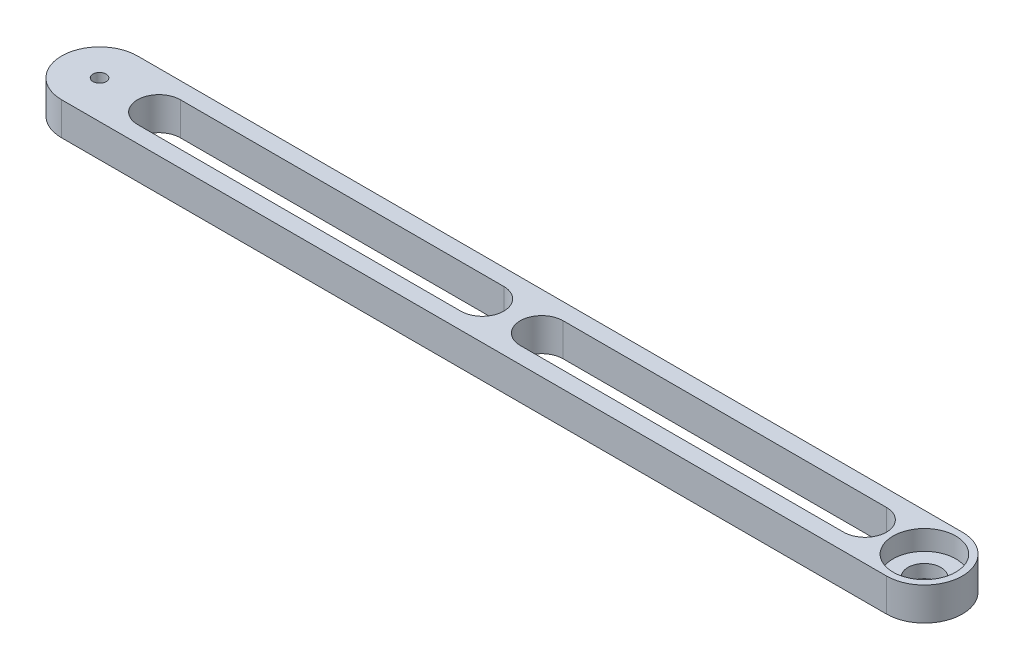
ISO-10303-21;
HEADER;
FILE_DESCRIPTION(('STEP AP214'),'2;1');
FILE_NAME('part.step','',(''),(''),'','','');
FILE_SCHEMA(('AUTOMOTIVE_DESIGN { 1 0 10303 214 1 1 1 1 }'));
ENDSEC;
DATA;
#1=APPLICATION_CONTEXT('core data for automotive mechanical design processes');
#2=APPLICATION_PROTOCOL_DEFINITION('international standard','automotive_design',2000,#1);
#3=PRODUCT_CONTEXT('',#1,'mechanical');
#4=PRODUCT('Part','Part','',(#3));
#5=PRODUCT_RELATED_PRODUCT_CATEGORY('part','',(#4));
#6=PRODUCT_DEFINITION_FORMATION('','',#4);
#7=PRODUCT_DEFINITION_CONTEXT('part definition',#1,'design');
#8=PRODUCT_DEFINITION('design','',#6,#7);
#9=PRODUCT_DEFINITION_SHAPE('','',#8);
#10=(LENGTH_UNIT() NAMED_UNIT(*) SI_UNIT(.MILLI.,.METRE.));
#11=(NAMED_UNIT(*) PLANE_ANGLE_UNIT() SI_UNIT($,.RADIAN.));
#12=(NAMED_UNIT(*) SI_UNIT($,.STERADIAN.) SOLID_ANGLE_UNIT());
#13=UNCERTAINTY_MEASURE_WITH_UNIT(LENGTH_MEASURE(1.E-05),#10,'distance_accuracy_value','');
#14=(GEOMETRIC_REPRESENTATION_CONTEXT(3) GLOBAL_UNCERTAINTY_ASSIGNED_CONTEXT((#13)) GLOBAL_UNIT_ASSIGNED_CONTEXT((#10,
#11,#12)) REPRESENTATION_CONTEXT('',''));
#15=CARTESIAN_POINT('',(0.,0.,0.));
#16=DIRECTION('',(0.,0.,1.));
#17=DIRECTION('',(1.,0.,0.));
#18=AXIS2_PLACEMENT_3D('',#15,#16,#17);
#19=CARTESIAN_POINT('',(0.,10.,0.));
#20=DIRECTION('',(0.,1.,0.));
#21=DIRECTION('',(0.,0.,1.));
#22=AXIS2_PLACEMENT_3D('',#19,#20,#21);
#23=PLANE('',#22);
#24=CARTESIAN_POINT('',(18.,10.,0.));
#25=DIRECTION('',(0.,1.,0.));
#26=DIRECTION('',(0.,0.,1.));
#27=AXIS2_PLACEMENT_3D('',#24,#25,#26);
#28=CIRCLE('',#27,6.5);
#29=CARTESIAN_POINT('',(18.,10.,-6.5));
#30=VERTEX_POINT('',#29);
#31=CARTESIAN_POINT('',(18.,10.,6.5));
#32=VERTEX_POINT('',#31);
#33=EDGE_CURVE('E50',#30,#32,#28,.T.);
#34=ORIENTED_EDGE('',*,*,#33,.F.);
#35=DIRECTION('',(-1.,0.,0.));
#36=VECTOR('',#35,1.);
#37=CARTESIAN_POINT('',(18.,10.,-6.5));
#38=LINE('',#37,#36);
#39=CARTESIAN_POINT('',(116.,10.,-6.5));
#40=VERTEX_POINT('',#39);
#41=EDGE_CURVE('E145',#40,#30,#38,.T.);
#42=ORIENTED_EDGE('',*,*,#41,.F.);
#43=CARTESIAN_POINT('',(116.,10.,0.));
#44=DIRECTION('',(0.,1.,0.));
#45=DIRECTION('',(0.,0.,1.));
#46=AXIS2_PLACEMENT_3D('',#43,#44,#45);
#47=CIRCLE('',#46,6.5);
#48=CARTESIAN_POINT('',(116.,10.,6.5));
#49=VERTEX_POINT('',#48);
#50=EDGE_CURVE('E148',#49,#40,#47,.T.);
#51=ORIENTED_EDGE('',*,*,#50,.F.);
#52=DIRECTION('',(1.,0.,0.));
#53=VECTOR('',#52,1.);
#54=CARTESIAN_POINT('',(18.,10.,6.5));
#55=LINE('',#54,#53);
#56=EDGE_CURVE('E154',#32,#49,#55,.T.);
#57=ORIENTED_EDGE('',*,*,#56,.F.);
#58=EDGE_LOOP('',(#34,#42,#51,#57));
#59=FACE_BOUND('',#58,.T.);
#60=CARTESIAN_POINT('',(134.,10.,0.));
#61=DIRECTION('',(0.,1.,0.));
#62=DIRECTION('',(0.,0.,1.));
#63=AXIS2_PLACEMENT_3D('',#60,#61,#62);
#64=CIRCLE('',#63,6.5);
#65=CARTESIAN_POINT('',(134.,10.,-6.5));
#66=VERTEX_POINT('',#65);
#67=CARTESIAN_POINT('',(134.,10.,6.5));
#68=VERTEX_POINT('',#67);
#69=EDGE_CURVE('E58',#66,#68,#64,.T.);
#70=ORIENTED_EDGE('',*,*,#69,.F.);
#71=DIRECTION('',(-1.,0.,0.));
#72=VECTOR('',#71,1.);
#73=CARTESIAN_POINT('',(134.,10.,-6.5));
#74=LINE('',#73,#72);
#75=CARTESIAN_POINT('',(232.,10.,-6.5));
#76=VERTEX_POINT('',#75);
#77=EDGE_CURVE('E169',#76,#66,#74,.T.);
#78=ORIENTED_EDGE('',*,*,#77,.F.);
#79=CARTESIAN_POINT('',(232.,10.,0.));
#80=DIRECTION('',(0.,1.,0.));
#81=DIRECTION('',(0.,0.,1.));
#82=AXIS2_PLACEMENT_3D('',#79,#80,#81);
#83=CIRCLE('',#82,6.5);
#84=CARTESIAN_POINT('',(232.,10.,6.5));
#85=VERTEX_POINT('',#84);
#86=EDGE_CURVE('E183',#85,#76,#83,.T.);
#87=ORIENTED_EDGE('',*,*,#86,.F.);
#88=DIRECTION('',(1.,0.,0.));
#89=VECTOR('',#88,1.);
#90=CARTESIAN_POINT('',(134.,10.,6.5));
#91=LINE('',#90,#89);
#92=EDGE_CURVE('E180',#68,#85,#91,.T.);
#93=ORIENTED_EDGE('',*,*,#92,.F.);
#94=EDGE_LOOP('',(#70,#78,#87,#93));
#95=FACE_BOUND('',#94,.T.);
#96=CARTESIAN_POINT('',(250.,10.,0.));
#97=DIRECTION('',(0.,1.,0.));
#98=DIRECTION('',(0.,0.,1.));
#99=AXIS2_PLACEMENT_3D('',#96,#97,#98);
#100=CIRCLE('',#99,9.50000000000001);
#101=CARTESIAN_POINT('',(250.,10.,9.50000000000001));
#102=VERTEX_POINT('',#101);
#103=EDGE_CURVE('E200',#102,#102,#100,.T.);
#104=ORIENTED_EDGE('',*,*,#103,.F.);
#105=EDGE_LOOP('',(#104));
#106=FACE_BOUND('',#105,.T.);
#107=CARTESIAN_POINT('',(0.,10.,0.));
#108=DIRECTION('',(0.,1.,0.));
#109=DIRECTION('',(0.,0.,1.));
#110=AXIS2_PLACEMENT_3D('',#107,#108,#109);
#111=CIRCLE('',#110,11.5);
#112=CARTESIAN_POINT('',(0.,10.,-11.5));
#113=VERTEX_POINT('',#112);
#114=CARTESIAN_POINT('',(0.,10.,11.5));
#115=VERTEX_POINT('',#114);
#116=EDGE_CURVE('E209',#113,#115,#111,.T.);
#117=ORIENTED_EDGE('',*,*,#116,.T.);
#118=DIRECTION('',(1.,0.,0.));
#119=VECTOR('',#118,1.);
#120=CARTESIAN_POINT('',(0.,10.,11.5));
#121=LINE('',#120,#119);
#122=CARTESIAN_POINT('',(250.,10.,11.5));
#123=VERTEX_POINT('',#122);
#124=EDGE_CURVE('E212',#115,#123,#121,.T.);
#125=ORIENTED_EDGE('',*,*,#124,.T.);
#126=CARTESIAN_POINT('',(250.,10.,0.));
#127=DIRECTION('',(0.,1.,0.));
#128=DIRECTION('',(0.,0.,1.));
#129=AXIS2_PLACEMENT_3D('',#126,#127,#128);
#130=CIRCLE('',#129,11.5);
#131=CARTESIAN_POINT('',(250.,10.,-11.5));
#132=VERTEX_POINT('',#131);
#133=EDGE_CURVE('E215',#123,#132,#130,.T.);
#134=ORIENTED_EDGE('',*,*,#133,.T.);
#135=DIRECTION('',(-1.,0.,0.));
#136=VECTOR('',#135,1.);
#137=CARTESIAN_POINT('',(0.,10.,-11.5));
#138=LINE('',#137,#136);
#139=EDGE_CURVE('E217',#132,#113,#138,.T.);
#140=ORIENTED_EDGE('',*,*,#139,.T.);
#141=EDGE_LOOP('',(#117,#125,#134,#140));
#142=FACE_BOUND('',#141,.T.);
#143=CARTESIAN_POINT('',(0.,10.,0.));
#144=DIRECTION('',(0.,1.,0.));
#145=DIRECTION('',(0.,0.,1.));
#146=AXIS2_PLACEMENT_3D('',#143,#144,#145);
#147=CIRCLE('',#146,2.);
#148=CARTESIAN_POINT('',(0.,10.,2.));
#149=VERTEX_POINT('',#148);
#150=EDGE_CURVE('E203',#149,#149,#147,.T.);
#151=ORIENTED_EDGE('',*,*,#150,.F.);
#152=EDGE_LOOP('',(#151));
#153=FACE_BOUND('',#152,.T.);
#154=ADVANCED_FACE('F34',(#59,#95,#106,#142,#153),#23,.T.);
#155=CARTESIAN_POINT('',(0.,0.,0.));
#156=DIRECTION('',(0.,1.,0.));
#157=DIRECTION('',(0.,0.,1.));
#158=AXIS2_PLACEMENT_3D('',#155,#156,#157);
#159=PLANE('',#158);
#160=DIRECTION('',(-1.,0.,0.));
#161=VECTOR('',#160,1.);
#162=CARTESIAN_POINT('',(18.,0.,-6.5));
#163=LINE('',#162,#161);
#164=CARTESIAN_POINT('',(116.,0.,-6.5));
#165=VERTEX_POINT('',#164);
#166=CARTESIAN_POINT('',(18.,0.,-6.5));
#167=VERTEX_POINT('',#166);
#168=EDGE_CURVE('E132',#165,#167,#163,.T.);
#169=ORIENTED_EDGE('',*,*,#168,.T.);
#170=CARTESIAN_POINT('',(18.,0.,0.));
#171=DIRECTION('',(0.,1.,0.));
#172=DIRECTION('',(0.,0.,1.));
#173=AXIS2_PLACEMENT_3D('',#170,#171,#172);
#174=CIRCLE('',#173,6.5);
#175=CARTESIAN_POINT('',(18.,0.,6.5));
#176=VERTEX_POINT('',#175);
#177=EDGE_CURVE('E126',#167,#176,#174,.T.);
#178=ORIENTED_EDGE('',*,*,#177,.T.);
#179=DIRECTION('',(1.,0.,0.));
#180=VECTOR('',#179,1.);
#181=CARTESIAN_POINT('',(18.,0.,6.5));
#182=LINE('',#181,#180);
#183=CARTESIAN_POINT('',(116.,0.,6.5));
#184=VERTEX_POINT('',#183);
#185=EDGE_CURVE('E136',#176,#184,#182,.T.);
#186=ORIENTED_EDGE('',*,*,#185,.T.);
#187=CARTESIAN_POINT('',(116.,0.,0.));
#188=DIRECTION('',(0.,1.,0.));
#189=DIRECTION('',(0.,0.,1.));
#190=AXIS2_PLACEMENT_3D('',#187,#188,#189);
#191=CIRCLE('',#190,6.5);
#192=EDGE_CURVE('E140',#184,#165,#191,.T.);
#193=ORIENTED_EDGE('',*,*,#192,.T.);
#194=EDGE_LOOP('',(#169,#178,#186,#193));
#195=FACE_BOUND('',#194,.T.);
#196=DIRECTION('',(-1.,0.,0.));
#197=VECTOR('',#196,1.);
#198=CARTESIAN_POINT('',(134.,0.,-6.5));
#199=LINE('',#198,#197);
#200=CARTESIAN_POINT('',(232.,0.,-6.5));
#201=VERTEX_POINT('',#200);
#202=CARTESIAN_POINT('',(134.,0.,-6.5));
#203=VERTEX_POINT('',#202);
#204=EDGE_CURVE('E175',#201,#203,#199,.T.);
#205=ORIENTED_EDGE('',*,*,#204,.T.);
#206=CARTESIAN_POINT('',(134.,0.,0.));
#207=DIRECTION('',(0.,1.,0.));
#208=DIRECTION('',(0.,0.,1.));
#209=AXIS2_PLACEMENT_3D('',#206,#207,#208);
#210=CIRCLE('',#209,6.5);
#211=CARTESIAN_POINT('',(134.,0.,6.5));
#212=VERTEX_POINT('',#211);
#213=EDGE_CURVE('E165',#203,#212,#210,.T.);
#214=ORIENTED_EDGE('',*,*,#213,.T.);
#215=DIRECTION('',(1.,0.,0.));
#216=VECTOR('',#215,1.);
#217=CARTESIAN_POINT('',(134.,0.,6.5));
#218=LINE('',#217,#216);
#219=CARTESIAN_POINT('',(232.,0.,6.5));
#220=VERTEX_POINT('',#219);
#221=EDGE_CURVE('E168',#212,#220,#218,.T.);
#222=ORIENTED_EDGE('',*,*,#221,.T.);
#223=CARTESIAN_POINT('',(232.,0.,0.));
#224=DIRECTION('',(0.,1.,0.));
#225=DIRECTION('',(0.,0.,1.));
#226=AXIS2_PLACEMENT_3D('',#223,#224,#225);
#227=CIRCLE('',#226,6.5);
#228=EDGE_CURVE('E172',#220,#201,#227,.T.);
#229=ORIENTED_EDGE('',*,*,#228,.T.);
#230=EDGE_LOOP('',(#205,#214,#222,#229));
#231=FACE_BOUND('',#230,.T.);
#232=CARTESIAN_POINT('',(250.,0.,0.));
#233=DIRECTION('',(0.,-1.,0.));
#234=DIRECTION('',(0.,0.,-1.));
#235=AXIS2_PLACEMENT_3D('',#232,#233,#234);
#236=CIRCLE('',#235,4.99999999999999);
#237=CARTESIAN_POINT('',(250.,0.,-4.99999999999999));
#238=VERTEX_POINT('',#237);
#239=EDGE_CURVE('E161',#238,#238,#236,.T.);
#240=ORIENTED_EDGE('',*,*,#239,.F.);
#241=EDGE_LOOP('',(#240));
#242=FACE_BOUND('',#241,.T.);
#243=CARTESIAN_POINT('',(0.,0.,0.));
#244=DIRECTION('',(0.,1.,0.));
#245=DIRECTION('',(0.,0.,1.));
#246=AXIS2_PLACEMENT_3D('',#243,#244,#245);
#247=CIRCLE('',#246,11.5);
#248=CARTESIAN_POINT('',(0.,0.,-11.5));
#249=VERTEX_POINT('',#248);
#250=CARTESIAN_POINT('',(0.,0.,11.5));
#251=VERTEX_POINT('',#250);
#252=EDGE_CURVE('E206',#249,#251,#247,.T.);
#253=ORIENTED_EDGE('',*,*,#252,.F.);
#254=DIRECTION('',(-1.,0.,0.));
#255=VECTOR('',#254,1.);
#256=CARTESIAN_POINT('',(0.,0.,-11.5));
#257=LINE('',#256,#255);
#258=CARTESIAN_POINT('',(250.,0.,-11.5));
#259=VERTEX_POINT('',#258);
#260=EDGE_CURVE('E213',#259,#249,#257,.T.);
#261=ORIENTED_EDGE('',*,*,#260,.F.);
#262=CARTESIAN_POINT('',(250.,0.,0.));
#263=DIRECTION('',(0.,1.,0.));
#264=DIRECTION('',(0.,0.,1.));
#265=AXIS2_PLACEMENT_3D('',#262,#263,#264);
#266=CIRCLE('',#265,11.5);
#267=CARTESIAN_POINT('',(250.,0.,11.5));
#268=VERTEX_POINT('',#267);
#269=EDGE_CURVE('E224',#268,#259,#266,.T.);
#270=ORIENTED_EDGE('',*,*,#269,.F.);
#271=DIRECTION('',(1.,0.,0.));
#272=VECTOR('',#271,1.);
#273=CARTESIAN_POINT('',(0.,0.,11.5));
#274=LINE('',#273,#272);
#275=EDGE_CURVE('E222',#251,#268,#274,.T.);
#276=ORIENTED_EDGE('',*,*,#275,.F.);
#277=EDGE_LOOP('',(#253,#261,#270,#276));
#278=FACE_BOUND('',#277,.T.);
#279=CARTESIAN_POINT('',(0.,0.,0.));
#280=DIRECTION('',(0.,1.,0.));
#281=DIRECTION('',(0.,0.,1.));
#282=AXIS2_PLACEMENT_3D('',#279,#280,#281);
#283=CIRCLE('',#282,2.);
#284=CARTESIAN_POINT('',(0.,0.,2.));
#285=VERTEX_POINT('',#284);
#286=EDGE_CURVE('E199',#285,#285,#283,.T.);
#287=ORIENTED_EDGE('',*,*,#286,.T.);
#288=EDGE_LOOP('',(#287));
#289=FACE_BOUND('',#288,.T.);
#290=ADVANCED_FACE('F142',(#195,#231,#242,#278,#289),#159,.F.);
#291=CARTESIAN_POINT('',(0.,10.,0.));
#292=DIRECTION('',(0.,-1.,0.));
#293=DIRECTION('',(0.,0.,-1.));
#294=AXIS2_PLACEMENT_3D('',#291,#292,#293);
#295=CYLINDRICAL_SURFACE('',#294,11.5);
#296=ORIENTED_EDGE('',*,*,#252,.T.);
#297=DIRECTION('',(0.,-1.,0.));
#298=VECTOR('',#297,1.);
#299=CARTESIAN_POINT('',(0.,10.,11.5));
#300=LINE('',#299,#298);
#301=EDGE_CURVE('E11',#115,#251,#300,.T.);
#302=ORIENTED_EDGE('',*,*,#301,.F.);
#303=ORIENTED_EDGE('',*,*,#116,.F.);
#304=DIRECTION('',(0.,-1.,0.));
#305=VECTOR('',#304,1.);
#306=CARTESIAN_POINT('',(0.,10.,-11.5));
#307=LINE('',#306,#305);
#308=EDGE_CURVE('E219',#113,#249,#307,.T.);
#309=ORIENTED_EDGE('',*,*,#308,.T.);
#310=EDGE_LOOP('',(#296,#302,#303,#309));
#311=FACE_BOUND('',#310,.T.);
#312=ADVANCED_FACE('F36',(#311),#295,.T.);
#313=CARTESIAN_POINT('',(0.,10.,11.5));
#314=DIRECTION('',(0.,0.,-1.));
#315=DIRECTION('',(-1.,0.,0.));
#316=AXIS2_PLACEMENT_3D('',#313,#314,#315);
#317=PLANE('',#316);
#318=ORIENTED_EDGE('',*,*,#275,.T.);
#319=DIRECTION('',(0.,-1.,0.));
#320=VECTOR('',#319,1.);
#321=CARTESIAN_POINT('',(250.,10.,11.5));
#322=LINE('',#321,#320);
#323=EDGE_CURVE('E43',#123,#268,#322,.T.);
#324=ORIENTED_EDGE('',*,*,#323,.F.);
#325=ORIENTED_EDGE('',*,*,#124,.F.);
#326=ORIENTED_EDGE('',*,*,#301,.T.);
#327=EDGE_LOOP('',(#318,#324,#325,#326));
#328=FACE_BOUND('',#327,.T.);
#329=ADVANCED_FACE('F253',(#328),#317,.F.);
#330=CARTESIAN_POINT('',(250.,10.,0.));
#331=DIRECTION('',(0.,-1.,0.));
#332=DIRECTION('',(0.,0.,-1.));
#333=AXIS2_PLACEMENT_3D('',#330,#331,#332);
#334=CYLINDRICAL_SURFACE('',#333,11.5);
#335=ORIENTED_EDGE('',*,*,#269,.T.);
#336=DIRECTION('',(0.,-1.,0.));
#337=VECTOR('',#336,1.);
#338=CARTESIAN_POINT('',(250.,10.,-11.5));
#339=LINE('',#338,#337);
#340=EDGE_CURVE('E229',#132,#259,#339,.T.);
#341=ORIENTED_EDGE('',*,*,#340,.F.);
#342=ORIENTED_EDGE('',*,*,#133,.F.);
#343=ORIENTED_EDGE('',*,*,#323,.T.);
#344=EDGE_LOOP('',(#335,#341,#342,#343));
#345=FACE_BOUND('',#344,.T.);
#346=ADVANCED_FACE('F237',(#345),#334,.T.);
#347=CARTESIAN_POINT('',(0.,10.,-11.5));
#348=DIRECTION('',(0.,0.,1.));
#349=DIRECTION('',(1.,0.,0.));
#350=AXIS2_PLACEMENT_3D('',#347,#348,#349);
#351=PLANE('',#350);
#352=ORIENTED_EDGE('',*,*,#260,.T.);
#353=ORIENTED_EDGE('',*,*,#308,.F.);
#354=ORIENTED_EDGE('',*,*,#139,.F.);
#355=ORIENTED_EDGE('',*,*,#340,.T.);
#356=EDGE_LOOP('',(#352,#353,#354,#355));
#357=FACE_BOUND('',#356,.T.);
#358=ADVANCED_FACE('F246',(#357),#351,.F.);
#359=CARTESIAN_POINT('',(0.,10.,0.));
#360=DIRECTION('',(0.,-1.,0.));
#361=DIRECTION('',(0.,0.,-1.));
#362=AXIS2_PLACEMENT_3D('',#359,#360,#361);
#363=CYLINDRICAL_SURFACE('',#362,2.);
#364=ORIENTED_EDGE('',*,*,#150,.T.);
#365=EDGE_LOOP('',(#364));
#366=FACE_BOUND('',#365,.T.);
#367=ORIENTED_EDGE('',*,*,#286,.F.);
#368=EDGE_LOOP('',(#367));
#369=FACE_BOUND('',#368,.T.);
#370=ADVANCED_FACE('F269',(#366,#369),#363,.F.);
#371=CARTESIAN_POINT('',(250.,4.,0.));
#372=DIRECTION('',(0.,1.,0.));
#373=DIRECTION('',(0.,0.,1.));
#374=AXIS2_PLACEMENT_3D('',#371,#372,#373);
#375=CYLINDRICAL_SURFACE('',#374,9.50000000000001);
#376=CARTESIAN_POINT('',(250.,4.,0.));
#377=DIRECTION('',(0.,1.,0.));
#378=DIRECTION('',(0.,0.,1.));
#379=AXIS2_PLACEMENT_3D('',#376,#377,#378);
#380=CIRCLE('',#379,9.50000000000001);
#381=CARTESIAN_POINT('',(250.,4.,9.50000000000001));
#382=VERTEX_POINT('',#381);
#383=EDGE_CURVE('E196',#382,#382,#380,.T.);
#384=ORIENTED_EDGE('',*,*,#383,.F.);
#385=EDGE_LOOP('',(#384));
#386=FACE_BOUND('',#385,.T.);
#387=ORIENTED_EDGE('',*,*,#103,.T.);
#388=EDGE_LOOP('',(#387));
#389=FACE_BOUND('',#388,.T.);
#390=ADVANCED_FACE('F276',(#386,#389),#375,.F.);
#391=CARTESIAN_POINT('',(250.,4.,0.));
#392=DIRECTION('',(0.,1.,0.));
#393=DIRECTION('',(0.,0.,1.));
#394=AXIS2_PLACEMENT_3D('',#391,#392,#393);
#395=PLANE('',#394);
#396=CARTESIAN_POINT('',(250.,4.,0.));
#397=DIRECTION('',(0.,1.,0.));
#398=DIRECTION('',(0.,0.,1.));
#399=AXIS2_PLACEMENT_3D('',#396,#397,#398);
#400=CIRCLE('',#399,4.99999999999999);
#401=CARTESIAN_POINT('',(250.,4.,4.99999999999999));
#402=VERTEX_POINT('',#401);
#403=EDGE_CURVE('E38',#402,#402,#400,.T.);
#404=ORIENTED_EDGE('',*,*,#403,.F.);
#405=EDGE_LOOP('',(#404));
#406=FACE_BOUND('',#405,.T.);
#407=ORIENTED_EDGE('',*,*,#383,.T.);
#408=EDGE_LOOP('',(#407));
#409=FACE_BOUND('',#408,.T.);
#410=ADVANCED_FACE('F281',(#406,#409),#395,.T.);
#411=CARTESIAN_POINT('',(250.,10.,0.));
#412=DIRECTION('',(0.,-1.,0.));
#413=DIRECTION('',(0.,0.,-1.));
#414=AXIS2_PLACEMENT_3D('',#411,#412,#413);
#415=CYLINDRICAL_SURFACE('',#414,4.99999999999999);
#416=ORIENTED_EDGE('',*,*,#403,.T.);
#417=EDGE_LOOP('',(#416));
#418=FACE_BOUND('',#417,.T.);
#419=ORIENTED_EDGE('',*,*,#239,.T.);
#420=EDGE_LOOP('',(#419));
#421=FACE_BOUND('',#420,.T.);
#422=ADVANCED_FACE('F289',(#418,#421),#415,.F.);
#423=CARTESIAN_POINT('',(134.,0.,0.));
#424=DIRECTION('',(0.,1.,0.));
#425=DIRECTION('',(0.,0.,1.));
#426=AXIS2_PLACEMENT_3D('',#423,#424,#425);
#427=CYLINDRICAL_SURFACE('',#426,6.5);
#428=ORIENTED_EDGE('',*,*,#69,.T.);
#429=DIRECTION('',(0.,1.,0.));
#430=VECTOR('',#429,1.);
#431=CARTESIAN_POINT('',(134.,0.,6.5));
#432=LINE('',#431,#430);
#433=EDGE_CURVE('E178',#212,#68,#432,.T.);
#434=ORIENTED_EDGE('',*,*,#433,.F.);
#435=ORIENTED_EDGE('',*,*,#213,.F.);
#436=DIRECTION('',(0.,1.,0.));
#437=VECTOR('',#436,1.);
#438=CARTESIAN_POINT('',(134.,0.,-6.5));
#439=LINE('',#438,#437);
#440=EDGE_CURVE('E155',#203,#66,#439,.T.);
#441=ORIENTED_EDGE('',*,*,#440,.T.);
#442=EDGE_LOOP('',(#428,#434,#435,#441));
#443=FACE_BOUND('',#442,.T.);
#444=ADVANCED_FACE('F297',(#443),#427,.F.);
#445=CARTESIAN_POINT('',(134.,0.,-6.5));
#446=DIRECTION('',(0.,0.,-1.));
#447=DIRECTION('',(-1.,0.,0.));
#448=AXIS2_PLACEMENT_3D('',#445,#446,#447);
#449=PLANE('',#448);
#450=ORIENTED_EDGE('',*,*,#77,.T.);
#451=ORIENTED_EDGE('',*,*,#440,.F.);
#452=ORIENTED_EDGE('',*,*,#204,.F.);
#453=DIRECTION('',(0.,1.,0.));
#454=VECTOR('',#453,1.);
#455=CARTESIAN_POINT('',(232.,0.,-6.5));
#456=LINE('',#455,#454);
#457=EDGE_CURVE('E189',#201,#76,#456,.T.);
#458=ORIENTED_EDGE('',*,*,#457,.T.);
#459=EDGE_LOOP('',(#450,#451,#452,#458));
#460=FACE_BOUND('',#459,.T.);
#461=ADVANCED_FACE('F301',(#460),#449,.F.);
#462=CARTESIAN_POINT('',(232.,0.,0.));
#463=DIRECTION('',(0.,1.,0.));
#464=DIRECTION('',(0.,0.,1.));
#465=AXIS2_PLACEMENT_3D('',#462,#463,#464);
#466=CYLINDRICAL_SURFACE('',#465,6.5);
#467=ORIENTED_EDGE('',*,*,#86,.T.);
#468=ORIENTED_EDGE('',*,*,#457,.F.);
#469=ORIENTED_EDGE('',*,*,#228,.F.);
#470=DIRECTION('',(0.,1.,0.));
#471=VECTOR('',#470,1.);
#472=CARTESIAN_POINT('',(232.,0.,6.5));
#473=LINE('',#472,#471);
#474=EDGE_CURVE('E191',#220,#85,#473,.T.);
#475=ORIENTED_EDGE('',*,*,#474,.T.);
#476=EDGE_LOOP('',(#467,#468,#469,#475));
#477=FACE_BOUND('',#476,.T.);
#478=ADVANCED_FACE('F305',(#477),#466,.F.);
#479=CARTESIAN_POINT('',(134.,0.,6.5));
#480=DIRECTION('',(0.,0.,1.));
#481=DIRECTION('',(1.,0.,0.));
#482=AXIS2_PLACEMENT_3D('',#479,#480,#481);
#483=PLANE('',#482);
#484=ORIENTED_EDGE('',*,*,#92,.T.);
#485=ORIENTED_EDGE('',*,*,#474,.F.);
#486=ORIENTED_EDGE('',*,*,#221,.F.);
#487=ORIENTED_EDGE('',*,*,#433,.T.);
#488=EDGE_LOOP('',(#484,#485,#486,#487));
#489=FACE_BOUND('',#488,.T.);
#490=ADVANCED_FACE('F302',(#489),#483,.F.);
#491=CARTESIAN_POINT('',(18.,0.,0.));
#492=DIRECTION('',(0.,1.,0.));
#493=DIRECTION('',(0.,0.,1.));
#494=AXIS2_PLACEMENT_3D('',#491,#492,#493);
#495=CYLINDRICAL_SURFACE('',#494,6.5);
#496=ORIENTED_EDGE('',*,*,#33,.T.);
#497=DIRECTION('',(0.,1.,0.));
#498=VECTOR('',#497,1.);
#499=CARTESIAN_POINT('',(18.,0.,6.5));
#500=LINE('',#499,#498);
#501=EDGE_CURVE('E122',#176,#32,#500,.T.);
#502=ORIENTED_EDGE('',*,*,#501,.F.);
#503=ORIENTED_EDGE('',*,*,#177,.F.);
#504=DIRECTION('',(0.,1.,0.));
#505=VECTOR('',#504,1.);
#506=CARTESIAN_POINT('',(18.,0.,-6.5));
#507=LINE('',#506,#505);
#508=EDGE_CURVE('E159',#167,#30,#507,.T.);
#509=ORIENTED_EDGE('',*,*,#508,.T.);
#510=EDGE_LOOP('',(#496,#502,#503,#509));
#511=FACE_BOUND('',#510,.T.);
#512=ADVANCED_FACE('F124',(#511),#495,.F.);
#513=CARTESIAN_POINT('',(18.,0.,-6.5));
#514=DIRECTION('',(0.,0.,-1.));
#515=DIRECTION('',(-1.,0.,0.));
#516=AXIS2_PLACEMENT_3D('',#513,#514,#515);
#517=PLANE('',#516);
#518=ORIENTED_EDGE('',*,*,#41,.T.);
#519=ORIENTED_EDGE('',*,*,#508,.F.);
#520=ORIENTED_EDGE('',*,*,#168,.F.);
#521=DIRECTION('',(0.,1.,0.));
#522=VECTOR('',#521,1.);
#523=CARTESIAN_POINT('',(116.,0.,-6.5));
#524=LINE('',#523,#522);
#525=EDGE_CURVE('E162',#165,#40,#524,.T.);
#526=ORIENTED_EDGE('',*,*,#525,.T.);
#527=EDGE_LOOP('',(#518,#519,#520,#526));
#528=FACE_BOUND('',#527,.T.);
#529=ADVANCED_FACE('F315',(#528),#517,.F.);
#530=CARTESIAN_POINT('',(116.,0.,0.));
#531=DIRECTION('',(0.,1.,0.));
#532=DIRECTION('',(0.,0.,1.));
#533=AXIS2_PLACEMENT_3D('',#530,#531,#532);
#534=CYLINDRICAL_SURFACE('',#533,6.5);
#535=ORIENTED_EDGE('',*,*,#50,.T.);
#536=ORIENTED_EDGE('',*,*,#525,.F.);
#537=ORIENTED_EDGE('',*,*,#192,.F.);
#538=DIRECTION('',(0.,1.,0.));
#539=VECTOR('',#538,1.);
#540=CARTESIAN_POINT('',(116.,0.,6.5));
#541=LINE('',#540,#539);
#542=EDGE_CURVE('E131',#184,#49,#541,.T.);
#543=ORIENTED_EDGE('',*,*,#542,.T.);
#544=EDGE_LOOP('',(#535,#536,#537,#543));
#545=FACE_BOUND('',#544,.T.);
#546=ADVANCED_FACE('F318',(#545),#534,.F.);
#547=CARTESIAN_POINT('',(18.,0.,6.5));
#548=DIRECTION('',(0.,0.,1.));
#549=DIRECTION('',(1.,0.,0.));
#550=AXIS2_PLACEMENT_3D('',#547,#548,#549);
#551=PLANE('',#550);
#552=ORIENTED_EDGE('',*,*,#56,.T.);
#553=ORIENTED_EDGE('',*,*,#542,.F.);
#554=ORIENTED_EDGE('',*,*,#185,.F.);
#555=ORIENTED_EDGE('',*,*,#501,.T.);
#556=EDGE_LOOP('',(#552,#553,#554,#555));
#557=FACE_BOUND('',#556,.T.);
#558=ADVANCED_FACE('F137',(#557),#551,.F.);
#559=CLOSED_SHELL('',(#154,#290,#312,#329,#346,#358,#370,#390,#410,#422,#444,#461,#478,#490,
#512,#529,#546,#558));
#560=MANIFOLD_SOLID_BREP('B2',#559);
#561=ADVANCED_BREP_SHAPE_REPRESENTATION('',(#18,#560),#14);
#562=SHAPE_DEFINITION_REPRESENTATION(#9,#561);
ENDSEC;
END-ISO-10303-21;
